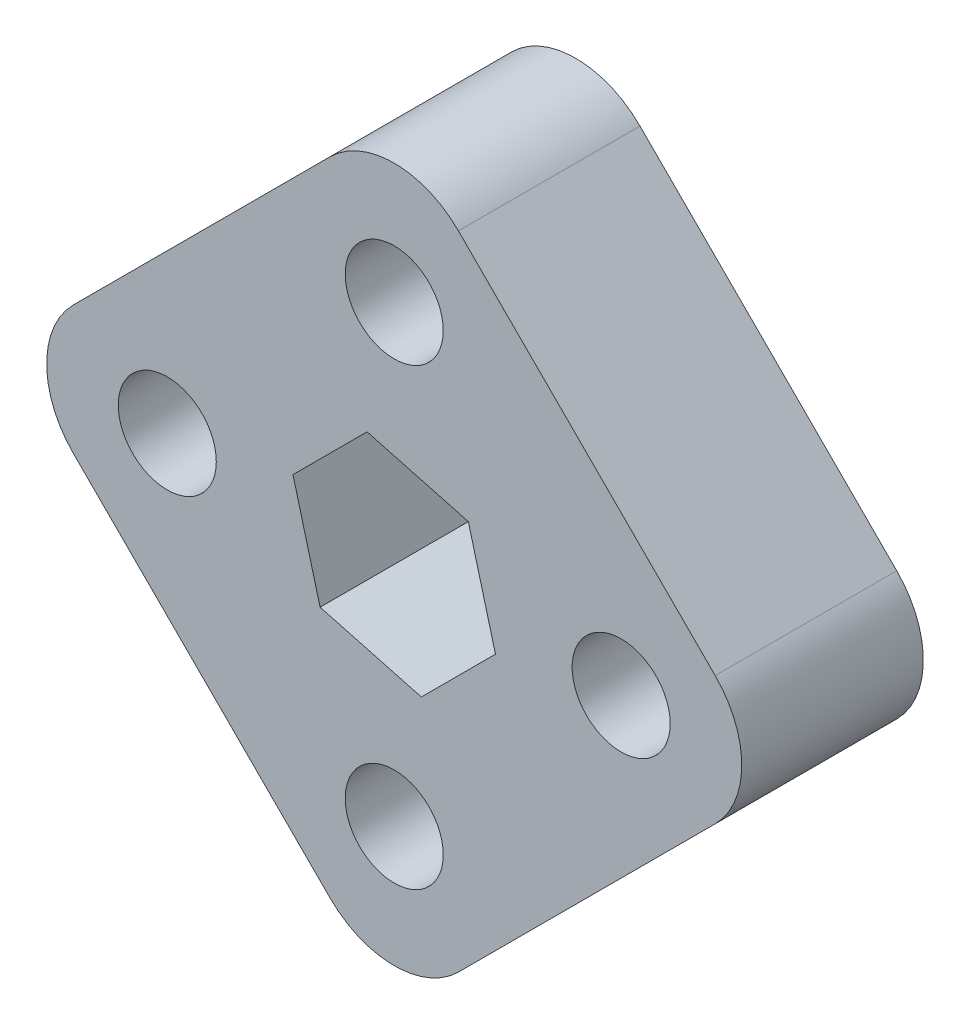
ISO-10303-21;
HEADER;
FILE_DESCRIPTION(('STEP AP214'),'2;1');
FILE_NAME('part.step','',(''),(''),'','','');
FILE_SCHEMA(('AUTOMOTIVE_DESIGN { 1 0 10303 214 1 1 1 1 }'));
ENDSEC;
DATA;
#1=APPLICATION_CONTEXT('core data for automotive mechanical design processes');
#2=APPLICATION_PROTOCOL_DEFINITION('international standard','automotive_design',2000,#1);
#3=PRODUCT_CONTEXT('',#1,'mechanical');
#4=PRODUCT('Part','Part','',(#3));
#5=PRODUCT_RELATED_PRODUCT_CATEGORY('part','',(#4));
#6=PRODUCT_DEFINITION_FORMATION('','',#4);
#7=PRODUCT_DEFINITION_CONTEXT('part definition',#1,'design');
#8=PRODUCT_DEFINITION('design','',#6,#7);
#9=PRODUCT_DEFINITION_SHAPE('','',#8);
#10=(LENGTH_UNIT() NAMED_UNIT(*) SI_UNIT(.MILLI.,.METRE.));
#11=(NAMED_UNIT(*) PLANE_ANGLE_UNIT() SI_UNIT($,.RADIAN.));
#12=(NAMED_UNIT(*) SI_UNIT($,.STERADIAN.) SOLID_ANGLE_UNIT());
#13=UNCERTAINTY_MEASURE_WITH_UNIT(LENGTH_MEASURE(1.E-05),#10,'distance_accuracy_value','');
#14=(GEOMETRIC_REPRESENTATION_CONTEXT(3) GLOBAL_UNCERTAINTY_ASSIGNED_CONTEXT((#13)) GLOBAL_UNIT_ASSIGNED_CONTEXT((#10,
#11,#12)) REPRESENTATION_CONTEXT('',''));
#15=CARTESIAN_POINT('',(0.,0.,0.));
#16=DIRECTION('',(0.,0.,1.));
#17=DIRECTION('',(1.,0.,0.));
#18=AXIS2_PLACEMENT_3D('',#15,#16,#17);
#19=CARTESIAN_POINT('',(-17.9605122421383,0.,12.7));
#20=DIRECTION('',(0.,0.,1.));
#21=DIRECTION('',(1.,0.,0.));
#22=AXIS2_PLACEMENT_3D('',#19,#20,#21);
#23=PLANE('',#22);
#24=CARTESIAN_POINT('',(0.,-15.875,12.7));
#25=DIRECTION('',(0.,0.,1.));
#26=DIRECTION('',(1.,0.,0.));
#27=AXIS2_PLACEMENT_3D('',#24,#25,#26);
#28=CIRCLE('',#27,3.42900000000011);
#29=CARTESIAN_POINT('',(3.42900000000011,-15.875,12.7));
#30=VERTEX_POINT('',#29);
#31=EDGE_CURVE('E410',#30,#30,#28,.T.);
#32=ORIENTED_EDGE('',*,*,#31,.F.);
#33=EDGE_LOOP('',(#32));
#34=FACE_BOUND('',#33,.T.);
#35=CARTESIAN_POINT('',(0.,15.875,12.7));
#36=DIRECTION('',(0.,0.,1.));
#37=DIRECTION('',(1.,0.,0.));
#38=AXIS2_PLACEMENT_3D('',#35,#36,#37);
#39=CIRCLE('',#38,3.429);
#40=CARTESIAN_POINT('',(3.429,15.875,12.7));
#41=VERTEX_POINT('',#40);
#42=EDGE_CURVE('E189',#41,#41,#39,.T.);
#43=ORIENTED_EDGE('',*,*,#42,.F.);
#44=EDGE_LOOP('',(#43));
#45=FACE_BOUND('',#44,.T.);
#46=CARTESIAN_POINT('',(-17.9605122421383,0.,12.7));
#47=DIRECTION('',(0.,0.,1.));
#48=DIRECTION('',(1.,0.,0.));
#49=AXIS2_PLACEMENT_3D('',#46,#47,#48);
#50=CIRCLE('',#49,6.35);
#51=CARTESIAN_POINT('',(-22.4506403026728,4.49012806053461,12.7));
#52=VERTEX_POINT('',#51);
#53=CARTESIAN_POINT('',(-22.4506403026728,-4.4901280605346,12.7));
#54=VERTEX_POINT('',#53);
#55=EDGE_CURVE('E219',#52,#54,#50,.T.);
#56=ORIENTED_EDGE('',*,*,#55,.T.);
#57=DIRECTION('',(0.707106781186547,-0.707106781186548,0.));
#58=VECTOR('',#57,1.);
#59=CARTESIAN_POINT('',(-22.4506403026728,-4.4901280605346,12.7));
#60=LINE('',#59,#58);
#61=CARTESIAN_POINT('',(-4.49012806053461,-22.4506403026729,12.7));
#62=VERTEX_POINT('',#61);
#63=EDGE_CURVE('E223',#54,#62,#60,.T.);
#64=ORIENTED_EDGE('',*,*,#63,.T.);
#65=CARTESIAN_POINT('',(0.,-17.9605122421383,12.7));
#66=DIRECTION('',(0.,0.,1.));
#67=DIRECTION('',(1.,0.,0.));
#68=AXIS2_PLACEMENT_3D('',#65,#66,#67);
#69=CIRCLE('',#68,6.35);
#70=CARTESIAN_POINT('',(4.49012806053461,-22.4506403026729,12.7));
#71=VERTEX_POINT('',#70);
#72=EDGE_CURVE('E227',#62,#71,#69,.T.);
#73=ORIENTED_EDGE('',*,*,#72,.T.);
#74=DIRECTION('',(0.707106781186547,0.707106781186547,0.));
#75=VECTOR('',#74,1.);
#76=CARTESIAN_POINT('',(4.49012806053461,-22.4506403026729,12.7));
#77=LINE('',#76,#75);
#78=CARTESIAN_POINT('',(22.4506403026729,-4.49012806053461,12.7));
#79=VERTEX_POINT('',#78);
#80=EDGE_CURVE('E230',#71,#79,#77,.T.);
#81=ORIENTED_EDGE('',*,*,#80,.T.);
#82=CARTESIAN_POINT('',(17.9605122421383,0.,12.7));
#83=DIRECTION('',(0.,0.,1.));
#84=DIRECTION('',(1.,0.,0.));
#85=AXIS2_PLACEMENT_3D('',#82,#83,#84);
#86=CIRCLE('',#85,6.35);
#87=CARTESIAN_POINT('',(22.4506403026729,4.49012806053461,12.7));
#88=VERTEX_POINT('',#87);
#89=EDGE_CURVE('E233',#79,#88,#86,.T.);
#90=ORIENTED_EDGE('',*,*,#89,.T.);
#91=DIRECTION('',(-0.707106781186548,0.707106781186548,0.));
#92=VECTOR('',#91,1.);
#93=CARTESIAN_POINT('',(22.4506403026729,4.49012806053461,12.7));
#94=LINE('',#93,#92);
#95=CARTESIAN_POINT('',(4.49012806053462,22.4506403026729,12.7));
#96=VERTEX_POINT('',#95);
#97=EDGE_CURVE('E236',#88,#96,#94,.T.);
#98=ORIENTED_EDGE('',*,*,#97,.T.);
#99=CARTESIAN_POINT('',(0.,17.9605122421383,12.7));
#100=DIRECTION('',(0.,0.,1.));
#101=DIRECTION('',(1.,0.,0.));
#102=AXIS2_PLACEMENT_3D('',#99,#100,#101);
#103=CIRCLE('',#102,6.35);
#104=CARTESIAN_POINT('',(-4.4901280605346,22.4506403026729,12.7));
#105=VERTEX_POINT('',#104);
#106=EDGE_CURVE('E239',#96,#105,#103,.T.);
#107=ORIENTED_EDGE('',*,*,#106,.T.);
#108=DIRECTION('',(-0.707106781186548,-0.707106781186547,0.));
#109=VECTOR('',#108,1.);
#110=CARTESIAN_POINT('',(-4.4901280605346,22.4506403026729,12.7));
#111=LINE('',#110,#109);
#112=EDGE_CURVE('E242',#105,#52,#111,.T.);
#113=ORIENTED_EDGE('',*,*,#112,.T.);
#114=EDGE_LOOP('',(#56,#64,#73,#81,#90,#98,#107,#113));
#115=FACE_BOUND('',#114,.T.);
#116=DIRECTION('',(-0.965925826289068,0.258819045102521,0.));
#117=VECTOR('',#116,1.);
#118=CARTESIAN_POINT('',(5.18475328889106,5.18475328889106,12.7));
#119=LINE('',#118,#117);
#120=CARTESIAN_POINT('',(5.18475328889106,5.18475328889106,12.7));
#121=VERTEX_POINT('',#120);
#122=CARTESIAN_POINT('',(-1.89775141608905,7.08250470498011,12.7));
#123=VERTEX_POINT('',#122);
#124=EDGE_CURVE('E156',#121,#123,#119,.T.);
#125=ORIENTED_EDGE('',*,*,#124,.F.);
#126=DIRECTION('',(-0.258819045102521,0.965925826289068,0.));
#127=VECTOR('',#126,1.);
#128=CARTESIAN_POINT('',(7.08250470498011,-1.89775141608905,12.7));
#129=LINE('',#128,#127);
#130=CARTESIAN_POINT('',(7.08250470498011,-1.89775141608905,12.7));
#131=VERTEX_POINT('',#130);
#132=EDGE_CURVE('E147',#131,#121,#129,.T.);
#133=ORIENTED_EDGE('',*,*,#132,.F.);
#134=DIRECTION('',(0.707106781186547,0.707106781186548,0.));
#135=VECTOR('',#134,1.);
#136=CARTESIAN_POINT('',(1.89775141608905,-7.08250470498011,12.7));
#137=LINE('',#136,#135);
#138=CARTESIAN_POINT('',(1.89775141608905,-7.08250470498011,12.7));
#139=VERTEX_POINT('',#138);
#140=EDGE_CURVE('E184',#139,#131,#137,.T.);
#141=ORIENTED_EDGE('',*,*,#140,.F.);
#142=DIRECTION('',(0.965925826289068,-0.258819045102521,0.));
#143=VECTOR('',#142,1.);
#144=CARTESIAN_POINT('',(-5.18475328889106,-5.18475328889106,12.7));
#145=LINE('',#144,#143);
#146=CARTESIAN_POINT('',(-5.18475328889106,-5.18475328889106,12.7));
#147=VERTEX_POINT('',#146);
#148=EDGE_CURVE('E181',#147,#139,#145,.T.);
#149=ORIENTED_EDGE('',*,*,#148,.F.);
#150=DIRECTION('',(0.258819045102521,-0.965925826289068,0.));
#151=VECTOR('',#150,1.);
#152=CARTESIAN_POINT('',(-7.08250470498011,1.89775141608905,12.7));
#153=LINE('',#152,#151);
#154=CARTESIAN_POINT('',(-7.08250470498011,1.89775141608905,12.7));
#155=VERTEX_POINT('',#154);
#156=EDGE_CURVE('E175',#155,#147,#153,.T.);
#157=ORIENTED_EDGE('',*,*,#156,.F.);
#158=DIRECTION('',(-0.707106781186547,-0.707106781186548,0.));
#159=VECTOR('',#158,1.);
#160=CARTESIAN_POINT('',(-1.89775141608905,7.08250470498011,12.7));
#161=LINE('',#160,#159);
#162=EDGE_CURVE('E171',#123,#155,#161,.T.);
#163=ORIENTED_EDGE('',*,*,#162,.F.);
#164=EDGE_LOOP('',(#125,#133,#141,#149,#157,#163));
#165=FACE_BOUND('',#164,.T.);
#166=CARTESIAN_POINT('',(15.875,0.,12.7));
#167=DIRECTION('',(0.,0.,1.));
#168=DIRECTION('',(1.,0.,0.));
#169=AXIS2_PLACEMENT_3D('',#166,#167,#168);
#170=CIRCLE('',#169,3.429);
#171=CARTESIAN_POINT('',(19.304,0.,12.7));
#172=VERTEX_POINT('',#171);
#173=EDGE_CURVE('E418',#172,#172,#170,.T.);
#174=ORIENTED_EDGE('',*,*,#173,.F.);
#175=EDGE_LOOP('',(#174));
#176=FACE_BOUND('',#175,.T.);
#177=CARTESIAN_POINT('',(-15.875,1.66281798762404E-13,12.7));
#178=DIRECTION('',(0.,0.,1.));
#179=DIRECTION('',(1.,0.,0.));
#180=AXIS2_PLACEMENT_3D('',#177,#178,#179);
#181=CIRCLE('',#180,3.429);
#182=CARTESIAN_POINT('',(-12.446,1.66281798762404E-13,12.7));
#183=VERTEX_POINT('',#182);
#184=EDGE_CURVE('E399',#183,#183,#181,.T.);
#185=ORIENTED_EDGE('',*,*,#184,.F.);
#186=EDGE_LOOP('',(#185));
#187=FACE_BOUND('',#186,.T.);
#188=ADVANCED_FACE('F45',(#34,#45,#115,#165,#176,#187),#23,.T.);
#189=CARTESIAN_POINT('',(-17.9605122421383,0.,0.));
#190=DIRECTION('',(0.,0.,1.));
#191=DIRECTION('',(1.,0.,0.));
#192=AXIS2_PLACEMENT_3D('',#189,#190,#191);
#193=PLANE('',#192);
#194=CARTESIAN_POINT('',(-17.9605122421383,0.,0.));
#195=DIRECTION('',(0.,0.,1.));
#196=DIRECTION('',(1.,0.,0.));
#197=AXIS2_PLACEMENT_3D('',#194,#195,#196);
#198=CIRCLE('',#197,6.35);
#199=CARTESIAN_POINT('',(-22.4506403026728,4.49012806053461,0.));
#200=VERTEX_POINT('',#199);
#201=CARTESIAN_POINT('',(-22.4506403026728,-4.4901280605346,0.));
#202=VERTEX_POINT('',#201);
#203=EDGE_CURVE('E165',#200,#202,#198,.T.);
#204=ORIENTED_EDGE('',*,*,#203,.F.);
#205=DIRECTION('',(-0.707106781186548,-0.707106781186547,0.));
#206=VECTOR('',#205,1.);
#207=CARTESIAN_POINT('',(-4.4901280605346,22.4506403026729,0.));
#208=LINE('',#207,#206);
#209=CARTESIAN_POINT('',(-4.4901280605346,22.4506403026729,0.));
#210=VERTEX_POINT('',#209);
#211=EDGE_CURVE('E224',#210,#200,#208,.T.);
#212=ORIENTED_EDGE('',*,*,#211,.F.);
#213=CARTESIAN_POINT('',(0.,17.9605122421383,0.));
#214=DIRECTION('',(0.,0.,1.));
#215=DIRECTION('',(1.,0.,0.));
#216=AXIS2_PLACEMENT_3D('',#213,#214,#215);
#217=CIRCLE('',#216,6.35);
#218=CARTESIAN_POINT('',(4.49012806053462,22.4506403026729,0.));
#219=VERTEX_POINT('',#218);
#220=EDGE_CURVE('E264',#219,#210,#217,.T.);
#221=ORIENTED_EDGE('',*,*,#220,.F.);
#222=DIRECTION('',(-0.707106781186548,0.707106781186548,0.));
#223=VECTOR('',#222,1.);
#224=CARTESIAN_POINT('',(22.4506403026729,4.49012806053461,0.));
#225=LINE('',#224,#223);
#226=CARTESIAN_POINT('',(22.4506403026729,4.49012806053461,0.));
#227=VERTEX_POINT('',#226);
#228=EDGE_CURVE('E261',#227,#219,#225,.T.);
#229=ORIENTED_EDGE('',*,*,#228,.F.);
#230=CARTESIAN_POINT('',(17.9605122421383,0.,0.));
#231=DIRECTION('',(0.,0.,1.));
#232=DIRECTION('',(1.,0.,0.));
#233=AXIS2_PLACEMENT_3D('',#230,#231,#232);
#234=CIRCLE('',#233,6.35);
#235=CARTESIAN_POINT('',(22.4506403026729,-4.49012806053461,0.));
#236=VERTEX_POINT('',#235);
#237=EDGE_CURVE('E258',#236,#227,#234,.T.);
#238=ORIENTED_EDGE('',*,*,#237,.F.);
#239=DIRECTION('',(0.707106781186547,0.707106781186547,0.));
#240=VECTOR('',#239,1.);
#241=CARTESIAN_POINT('',(4.49012806053461,-22.4506403026729,0.));
#242=LINE('',#241,#240);
#243=CARTESIAN_POINT('',(4.49012806053461,-22.4506403026729,0.));
#244=VERTEX_POINT('',#243);
#245=EDGE_CURVE('E255',#244,#236,#242,.T.);
#246=ORIENTED_EDGE('',*,*,#245,.F.);
#247=CARTESIAN_POINT('',(0.,-17.9605122421383,0.));
#248=DIRECTION('',(0.,0.,1.));
#249=DIRECTION('',(1.,0.,0.));
#250=AXIS2_PLACEMENT_3D('',#247,#248,#249);
#251=CIRCLE('',#250,6.35);
#252=CARTESIAN_POINT('',(-4.49012806053461,-22.4506403026729,0.));
#253=VERTEX_POINT('',#252);
#254=EDGE_CURVE('E252',#253,#244,#251,.T.);
#255=ORIENTED_EDGE('',*,*,#254,.F.);
#256=DIRECTION('',(0.707106781186547,-0.707106781186548,0.));
#257=VECTOR('',#256,1.);
#258=CARTESIAN_POINT('',(-22.4506403026728,-4.4901280605346,0.));
#259=LINE('',#258,#257);
#260=EDGE_CURVE('E249',#202,#253,#259,.T.);
#261=ORIENTED_EDGE('',*,*,#260,.F.);
#262=EDGE_LOOP('',(#204,#212,#221,#229,#238,#246,#255,#261));
#263=FACE_BOUND('',#262,.T.);
#264=DIRECTION('',(-0.258819045102521,0.965925826289068,0.));
#265=VECTOR('',#264,1.);
#266=CARTESIAN_POINT('',(7.08250470498011,-1.89775141608905,0.));
#267=LINE('',#266,#265);
#268=CARTESIAN_POINT('',(7.08250470498011,-1.89775141608905,0.));
#269=VERTEX_POINT('',#268);
#270=CARTESIAN_POINT('',(5.18475328889106,5.18475328889106,0.));
#271=VERTEX_POINT('',#270);
#272=EDGE_CURVE('E69',#269,#271,#267,.T.);
#273=ORIENTED_EDGE('',*,*,#272,.T.);
#274=DIRECTION('',(-0.965925826289068,0.258819045102521,0.));
#275=VECTOR('',#274,1.);
#276=CARTESIAN_POINT('',(5.18475328889106,5.18475328889106,0.));
#277=LINE('',#276,#275);
#278=CARTESIAN_POINT('',(-1.89775141608905,7.08250470498011,0.));
#279=VERTEX_POINT('',#278);
#280=EDGE_CURVE('E163',#271,#279,#277,.T.);
#281=ORIENTED_EDGE('',*,*,#280,.T.);
#282=DIRECTION('',(-0.707106781186547,-0.707106781186548,0.));
#283=VECTOR('',#282,1.);
#284=CARTESIAN_POINT('',(-1.89775141608905,7.08250470498011,0.));
#285=LINE('',#284,#283);
#286=CARTESIAN_POINT('',(-7.08250470498011,1.89775141608905,0.));
#287=VERTEX_POINT('',#286);
#288=EDGE_CURVE('E192',#279,#287,#285,.T.);
#289=ORIENTED_EDGE('',*,*,#288,.T.);
#290=DIRECTION('',(0.258819045102521,-0.965925826289068,0.));
#291=VECTOR('',#290,1.);
#292=CARTESIAN_POINT('',(-7.08250470498011,1.89775141608905,0.));
#293=LINE('',#292,#291);
#294=CARTESIAN_POINT('',(-5.18475328889106,-5.18475328889106,0.));
#295=VERTEX_POINT('',#294);
#296=EDGE_CURVE('E196',#287,#295,#293,.T.);
#297=ORIENTED_EDGE('',*,*,#296,.T.);
#298=DIRECTION('',(0.965925826289068,-0.258819045102521,0.));
#299=VECTOR('',#298,1.);
#300=CARTESIAN_POINT('',(-5.18475328889106,-5.18475328889106,0.));
#301=LINE('',#300,#299);
#302=CARTESIAN_POINT('',(1.89775141608905,-7.08250470498011,0.));
#303=VERTEX_POINT('',#302);
#304=EDGE_CURVE('E200',#295,#303,#301,.T.);
#305=ORIENTED_EDGE('',*,*,#304,.T.);
#306=DIRECTION('',(0.707106781186547,0.707106781186548,0.));
#307=VECTOR('',#306,1.);
#308=CARTESIAN_POINT('',(1.89775141608905,-7.08250470498011,0.));
#309=LINE('',#308,#307);
#310=EDGE_CURVE('E157',#303,#269,#309,.T.);
#311=ORIENTED_EDGE('',*,*,#310,.T.);
#312=EDGE_LOOP('',(#273,#281,#289,#297,#305,#311));
#313=FACE_BOUND('',#312,.T.);
#314=CARTESIAN_POINT('',(0.,15.875,0.));
#315=DIRECTION('',(0.,0.,1.));
#316=DIRECTION('',(1.,0.,0.));
#317=AXIS2_PLACEMENT_3D('',#314,#315,#316);
#318=CIRCLE('',#317,3.429);
#319=CARTESIAN_POINT('',(3.429,15.875,0.));
#320=VERTEX_POINT('',#319);
#321=EDGE_CURVE('E422',#320,#320,#318,.T.);
#322=ORIENTED_EDGE('',*,*,#321,.T.);
#323=EDGE_LOOP('',(#322));
#324=FACE_BOUND('',#323,.T.);
#325=CARTESIAN_POINT('',(15.875,0.,0.));
#326=DIRECTION('',(0.,0.,1.));
#327=DIRECTION('',(1.,0.,0.));
#328=AXIS2_PLACEMENT_3D('',#325,#326,#327);
#329=CIRCLE('',#328,3.429);
#330=CARTESIAN_POINT('',(19.304,0.,0.));
#331=VERTEX_POINT('',#330);
#332=EDGE_CURVE('E414',#331,#331,#329,.T.);
#333=ORIENTED_EDGE('',*,*,#332,.T.);
#334=EDGE_LOOP('',(#333));
#335=FACE_BOUND('',#334,.T.);
#336=CARTESIAN_POINT('',(0.,-15.875,0.));
#337=DIRECTION('',(0.,0.,1.));
#338=DIRECTION('',(1.,0.,0.));
#339=AXIS2_PLACEMENT_3D('',#336,#337,#338);
#340=CIRCLE('',#339,3.42900000000011);
#341=CARTESIAN_POINT('',(3.42900000000011,-15.875,0.));
#342=VERTEX_POINT('',#341);
#343=EDGE_CURVE('E407',#342,#342,#340,.T.);
#344=ORIENTED_EDGE('',*,*,#343,.T.);
#345=EDGE_LOOP('',(#344));
#346=FACE_BOUND('',#345,.T.);
#347=CARTESIAN_POINT('',(-15.875,1.66281798762404E-13,0.));
#348=DIRECTION('',(0.,0.,1.));
#349=DIRECTION('',(1.,0.,0.));
#350=AXIS2_PLACEMENT_3D('',#347,#348,#349);
#351=CIRCLE('',#350,3.429);
#352=CARTESIAN_POINT('',(-12.446,1.66281798762404E-13,0.));
#353=VERTEX_POINT('',#352);
#354=EDGE_CURVE('E402',#353,#353,#351,.T.);
#355=ORIENTED_EDGE('',*,*,#354,.T.);
#356=EDGE_LOOP('',(#355));
#357=FACE_BOUND('',#356,.T.);
#358=ADVANCED_FACE('F303',(#263,#313,#324,#335,#346,#357),#193,.F.);
#359=CARTESIAN_POINT('',(-17.9605122421383,0.,12.7));
#360=DIRECTION('',(0.,0.,-1.));
#361=DIRECTION('',(-1.,0.,0.));
#362=AXIS2_PLACEMENT_3D('',#359,#360,#361);
#363=CYLINDRICAL_SURFACE('',#362,6.35);
#364=ORIENTED_EDGE('',*,*,#203,.T.);
#365=DIRECTION('',(0.,0.,-1.));
#366=VECTOR('',#365,1.);
#367=CARTESIAN_POINT('',(-22.4506403026728,-4.4901280605346,12.7));
#368=LINE('',#367,#366);
#369=EDGE_CURVE('E11',#54,#202,#368,.T.);
#370=ORIENTED_EDGE('',*,*,#369,.F.);
#371=ORIENTED_EDGE('',*,*,#55,.F.);
#372=DIRECTION('',(0.,0.,-1.));
#373=VECTOR('',#372,1.);
#374=CARTESIAN_POINT('',(-22.4506403026728,4.49012806053461,12.7));
#375=LINE('',#374,#373);
#376=EDGE_CURVE('E245',#52,#200,#375,.T.);
#377=ORIENTED_EDGE('',*,*,#376,.T.);
#378=EDGE_LOOP('',(#364,#370,#371,#377));
#379=FACE_BOUND('',#378,.T.);
#380=ADVANCED_FACE('F47',(#379),#363,.T.);
#381=CARTESIAN_POINT('',(-22.4506403026728,-4.4901280605346,12.7));
#382=DIRECTION('',(0.707106781186548,0.707106781186547,0.));
#383=DIRECTION('',(-0.707106781186547,0.707106781186548,0.));
#384=AXIS2_PLACEMENT_3D('',#381,#382,#383);
#385=PLANE('',#384);
#386=ORIENTED_EDGE('',*,*,#260,.T.);
#387=DIRECTION('',(0.,0.,-1.));
#388=VECTOR('',#387,1.);
#389=CARTESIAN_POINT('',(-4.49012806053461,-22.4506403026729,12.7));
#390=LINE('',#389,#388);
#391=EDGE_CURVE('E54',#62,#253,#390,.T.);
#392=ORIENTED_EDGE('',*,*,#391,.F.);
#393=ORIENTED_EDGE('',*,*,#63,.F.);
#394=ORIENTED_EDGE('',*,*,#369,.T.);
#395=EDGE_LOOP('',(#386,#392,#393,#394));
#396=FACE_BOUND('',#395,.T.);
#397=ADVANCED_FACE('F320',(#396),#385,.F.);
#398=CARTESIAN_POINT('',(0.,-17.9605122421383,12.7));
#399=DIRECTION('',(0.,0.,-1.));
#400=DIRECTION('',(-1.,0.,0.));
#401=AXIS2_PLACEMENT_3D('',#398,#399,#400);
#402=CYLINDRICAL_SURFACE('',#401,6.35);
#403=ORIENTED_EDGE('',*,*,#254,.T.);
#404=DIRECTION('',(0.,0.,-1.));
#405=VECTOR('',#404,1.);
#406=CARTESIAN_POINT('',(4.49012806053461,-22.4506403026729,12.7));
#407=LINE('',#406,#405);
#408=EDGE_CURVE('E288',#71,#244,#407,.T.);
#409=ORIENTED_EDGE('',*,*,#408,.F.);
#410=ORIENTED_EDGE('',*,*,#72,.F.);
#411=ORIENTED_EDGE('',*,*,#391,.T.);
#412=EDGE_LOOP('',(#403,#409,#410,#411));
#413=FACE_BOUND('',#412,.T.);
#414=ADVANCED_FACE('F297',(#413),#402,.T.);
#415=CARTESIAN_POINT('',(4.49012806053461,-22.4506403026729,12.7));
#416=DIRECTION('',(-0.707106781186548,0.707106781186548,0.));
#417=DIRECTION('',(-0.707106781186548,-0.707106781186548,0.));
#418=AXIS2_PLACEMENT_3D('',#415,#416,#417);
#419=PLANE('',#418);
#420=ORIENTED_EDGE('',*,*,#245,.T.);
#421=DIRECTION('',(0.,0.,-1.));
#422=VECTOR('',#421,1.);
#423=CARTESIAN_POINT('',(22.4506403026729,-4.49012806053461,12.7));
#424=LINE('',#423,#422);
#425=EDGE_CURVE('E284',#79,#236,#424,.T.);
#426=ORIENTED_EDGE('',*,*,#425,.F.);
#427=ORIENTED_EDGE('',*,*,#80,.F.);
#428=ORIENTED_EDGE('',*,*,#408,.T.);
#429=EDGE_LOOP('',(#420,#426,#427,#428));
#430=FACE_BOUND('',#429,.T.);
#431=ADVANCED_FACE('F309',(#430),#419,.F.);
#432=CARTESIAN_POINT('',(17.9605122421383,0.,12.7));
#433=DIRECTION('',(0.,0.,-1.));
#434=DIRECTION('',(-1.,0.,0.));
#435=AXIS2_PLACEMENT_3D('',#432,#433,#434);
#436=CYLINDRICAL_SURFACE('',#435,6.35);
#437=ORIENTED_EDGE('',*,*,#237,.T.);
#438=DIRECTION('',(0.,0.,-1.));
#439=VECTOR('',#438,1.);
#440=CARTESIAN_POINT('',(22.4506403026729,4.49012806053461,12.7));
#441=LINE('',#440,#439);
#442=EDGE_CURVE('E280',#88,#227,#441,.T.);
#443=ORIENTED_EDGE('',*,*,#442,.F.);
#444=ORIENTED_EDGE('',*,*,#89,.F.);
#445=ORIENTED_EDGE('',*,*,#425,.T.);
#446=EDGE_LOOP('',(#437,#443,#444,#445));
#447=FACE_BOUND('',#446,.T.);
#448=ADVANCED_FACE('F313',(#447),#436,.T.);
#449=CARTESIAN_POINT('',(22.4506403026729,4.49012806053461,12.7));
#450=DIRECTION('',(-0.707106781186548,-0.707106781186548,0.));
#451=DIRECTION('',(0.707106781186548,-0.707106781186548,0.));
#452=AXIS2_PLACEMENT_3D('',#449,#450,#451);
#453=PLANE('',#452);
#454=ORIENTED_EDGE('',*,*,#228,.T.);
#455=DIRECTION('',(0.,0.,-1.));
#456=VECTOR('',#455,1.);
#457=CARTESIAN_POINT('',(4.49012806053462,22.4506403026729,12.7));
#458=LINE('',#457,#456);
#459=EDGE_CURVE('E276',#96,#219,#458,.T.);
#460=ORIENTED_EDGE('',*,*,#459,.F.);
#461=ORIENTED_EDGE('',*,*,#97,.F.);
#462=ORIENTED_EDGE('',*,*,#442,.T.);
#463=EDGE_LOOP('',(#454,#460,#461,#462));
#464=FACE_BOUND('',#463,.T.);
#465=ADVANCED_FACE('F333',(#464),#453,.F.);
#466=CARTESIAN_POINT('',(0.,17.9605122421383,12.7));
#467=DIRECTION('',(0.,0.,-1.));
#468=DIRECTION('',(-1.,0.,0.));
#469=AXIS2_PLACEMENT_3D('',#466,#467,#468);
#470=CYLINDRICAL_SURFACE('',#469,6.35);
#471=ORIENTED_EDGE('',*,*,#220,.T.);
#472=DIRECTION('',(0.,0.,-1.));
#473=VECTOR('',#472,1.);
#474=CARTESIAN_POINT('',(-4.4901280605346,22.4506403026729,12.7));
#475=LINE('',#474,#473);
#476=EDGE_CURVE('E272',#105,#210,#475,.T.);
#477=ORIENTED_EDGE('',*,*,#476,.F.);
#478=ORIENTED_EDGE('',*,*,#106,.F.);
#479=ORIENTED_EDGE('',*,*,#459,.T.);
#480=EDGE_LOOP('',(#471,#477,#478,#479));
#481=FACE_BOUND('',#480,.T.);
#482=ADVANCED_FACE('F331',(#481),#470,.T.);
#483=CARTESIAN_POINT('',(-4.4901280605346,22.4506403026729,12.7));
#484=DIRECTION('',(0.707106781186547,-0.707106781186548,0.));
#485=DIRECTION('',(0.707106781186548,0.707106781186547,0.));
#486=AXIS2_PLACEMENT_3D('',#483,#484,#485);
#487=PLANE('',#486);
#488=ORIENTED_EDGE('',*,*,#211,.T.);
#489=ORIENTED_EDGE('',*,*,#376,.F.);
#490=ORIENTED_EDGE('',*,*,#112,.F.);
#491=ORIENTED_EDGE('',*,*,#476,.T.);
#492=EDGE_LOOP('',(#488,#489,#490,#491));
#493=FACE_BOUND('',#492,.T.);
#494=ADVANCED_FACE('F326',(#493),#487,.F.);
#495=CARTESIAN_POINT('',(7.08250470498011,-1.89775141608905,12.7));
#496=DIRECTION('',(-0.965925826289068,-0.258819045102521,0.));
#497=DIRECTION('',(0.258819045102521,-0.965925826289068,0.));
#498=AXIS2_PLACEMENT_3D('',#495,#496,#497);
#499=PLANE('',#498);
#500=ORIENTED_EDGE('',*,*,#272,.F.);
#501=DIRECTION('',(0.,0.,-1.));
#502=VECTOR('',#501,1.);
#503=CARTESIAN_POINT('',(7.08250470498011,-1.89775141608905,12.7));
#504=LINE('',#503,#502);
#505=EDGE_CURVE('E151',#131,#269,#504,.T.);
#506=ORIENTED_EDGE('',*,*,#505,.F.);
#507=ORIENTED_EDGE('',*,*,#132,.T.);
#508=DIRECTION('',(0.,0.,-1.));
#509=VECTOR('',#508,1.);
#510=CARTESIAN_POINT('',(5.18475328889106,5.18475328889106,12.7));
#511=LINE('',#510,#509);
#512=EDGE_CURVE('E150',#121,#271,#511,.T.);
#513=ORIENTED_EDGE('',*,*,#512,.T.);
#514=EDGE_LOOP('',(#500,#506,#507,#513));
#515=FACE_BOUND('',#514,.T.);
#516=ADVANCED_FACE('F149',(#515),#499,.T.);
#517=CARTESIAN_POINT('',(5.18475328889106,5.18475328889106,12.7));
#518=DIRECTION('',(-0.258819045102521,-0.965925826289068,0.));
#519=DIRECTION('',(0.965925826289068,-0.258819045102521,0.));
#520=AXIS2_PLACEMENT_3D('',#517,#518,#519);
#521=PLANE('',#520);
#522=ORIENTED_EDGE('',*,*,#280,.F.);
#523=ORIENTED_EDGE('',*,*,#512,.F.);
#524=ORIENTED_EDGE('',*,*,#124,.T.);
#525=DIRECTION('',(0.,0.,-1.));
#526=VECTOR('',#525,1.);
#527=CARTESIAN_POINT('',(-1.89775141608905,7.08250470498011,12.7));
#528=LINE('',#527,#526);
#529=EDGE_CURVE('E166',#123,#279,#528,.T.);
#530=ORIENTED_EDGE('',*,*,#529,.T.);
#531=EDGE_LOOP('',(#522,#523,#524,#530));
#532=FACE_BOUND('',#531,.T.);
#533=ADVANCED_FACE('F160',(#532),#521,.T.);
#534=CARTESIAN_POINT('',(-1.89775141608905,7.08250470498011,12.7));
#535=DIRECTION('',(0.707106781186548,-0.707106781186547,0.));
#536=DIRECTION('',(0.707106781186547,0.707106781186548,0.));
#537=AXIS2_PLACEMENT_3D('',#534,#535,#536);
#538=PLANE('',#537);
#539=ORIENTED_EDGE('',*,*,#288,.F.);
#540=ORIENTED_EDGE('',*,*,#529,.F.);
#541=ORIENTED_EDGE('',*,*,#162,.T.);
#542=DIRECTION('',(0.,0.,-1.));
#543=VECTOR('',#542,1.);
#544=CARTESIAN_POINT('',(-7.08250470498011,1.89775141608905,12.7));
#545=LINE('',#544,#543);
#546=EDGE_CURVE('E214',#155,#287,#545,.T.);
#547=ORIENTED_EDGE('',*,*,#546,.T.);
#548=EDGE_LOOP('',(#539,#540,#541,#547));
#549=FACE_BOUND('',#548,.T.);
#550=ADVANCED_FACE('F361',(#549),#538,.T.);
#551=CARTESIAN_POINT('',(-7.08250470498011,1.89775141608905,12.7));
#552=DIRECTION('',(0.965925826289068,0.258819045102521,0.));
#553=DIRECTION('',(-0.258819045102521,0.965925826289068,0.));
#554=AXIS2_PLACEMENT_3D('',#551,#552,#553);
#555=PLANE('',#554);
#556=ORIENTED_EDGE('',*,*,#296,.F.);
#557=ORIENTED_EDGE('',*,*,#546,.F.);
#558=ORIENTED_EDGE('',*,*,#156,.T.);
#559=DIRECTION('',(0.,0.,-1.));
#560=VECTOR('',#559,1.);
#561=CARTESIAN_POINT('',(-5.18475328889106,-5.18475328889106,12.7));
#562=LINE('',#561,#560);
#563=EDGE_CURVE('E211',#147,#295,#562,.T.);
#564=ORIENTED_EDGE('',*,*,#563,.T.);
#565=EDGE_LOOP('',(#556,#557,#558,#564));
#566=FACE_BOUND('',#565,.T.);
#567=ADVANCED_FACE('F365',(#566),#555,.T.);
#568=CARTESIAN_POINT('',(-5.18475328889106,-5.18475328889106,12.7));
#569=DIRECTION('',(0.258819045102521,0.965925826289068,0.));
#570=DIRECTION('',(-0.965925826289068,0.258819045102521,0.));
#571=AXIS2_PLACEMENT_3D('',#568,#569,#570);
#572=PLANE('',#571);
#573=ORIENTED_EDGE('',*,*,#304,.F.);
#574=ORIENTED_EDGE('',*,*,#563,.F.);
#575=ORIENTED_EDGE('',*,*,#148,.T.);
#576=DIRECTION('',(0.,0.,-1.));
#577=VECTOR('',#576,1.);
#578=CARTESIAN_POINT('',(1.89775141608905,-7.08250470498011,12.7));
#579=LINE('',#578,#577);
#580=EDGE_CURVE('E61',#139,#303,#579,.T.);
#581=ORIENTED_EDGE('',*,*,#580,.T.);
#582=EDGE_LOOP('',(#573,#574,#575,#581));
#583=FACE_BOUND('',#582,.T.);
#584=ADVANCED_FACE('F371',(#583),#572,.T.);
#585=CARTESIAN_POINT('',(1.89775141608905,-7.08250470498011,12.7));
#586=DIRECTION('',(-0.707106781186548,0.707106781186547,0.));
#587=DIRECTION('',(-0.707106781186547,-0.707106781186548,0.));
#588=AXIS2_PLACEMENT_3D('',#585,#586,#587);
#589=PLANE('',#588);
#590=ORIENTED_EDGE('',*,*,#310,.F.);
#591=ORIENTED_EDGE('',*,*,#580,.F.);
#592=ORIENTED_EDGE('',*,*,#140,.T.);
#593=ORIENTED_EDGE('',*,*,#505,.T.);
#594=EDGE_LOOP('',(#590,#591,#592,#593));
#595=FACE_BOUND('',#594,.T.);
#596=ADVANCED_FACE('F375',(#595),#589,.T.);
#597=CARTESIAN_POINT('',(0.,15.875,12.7));
#598=DIRECTION('',(0.,0.,-1.));
#599=DIRECTION('',(-1.,0.,0.));
#600=AXIS2_PLACEMENT_3D('',#597,#598,#599);
#601=CYLINDRICAL_SURFACE('',#600,3.429);
#602=ORIENTED_EDGE('',*,*,#42,.T.);
#603=EDGE_LOOP('',(#602));
#604=FACE_BOUND('',#603,.T.);
#605=ORIENTED_EDGE('',*,*,#321,.F.);
#606=EDGE_LOOP('',(#605));
#607=FACE_BOUND('',#606,.T.);
#608=ADVANCED_FACE('F379',(#604,#607),#601,.F.);
#609=CARTESIAN_POINT('',(15.875,0.,12.7));
#610=DIRECTION('',(0.,0.,-1.));
#611=DIRECTION('',(-1.,0.,0.));
#612=AXIS2_PLACEMENT_3D('',#609,#610,#611);
#613=CYLINDRICAL_SURFACE('',#612,3.429);
#614=ORIENTED_EDGE('',*,*,#173,.T.);
#615=EDGE_LOOP('',(#614));
#616=FACE_BOUND('',#615,.T.);
#617=ORIENTED_EDGE('',*,*,#332,.F.);
#618=EDGE_LOOP('',(#617));
#619=FACE_BOUND('',#618,.T.);
#620=ADVANCED_FACE('F382',(#616,#619),#613,.F.);
#621=CARTESIAN_POINT('',(0.,-15.875,12.7));
#622=DIRECTION('',(0.,0.,-1.));
#623=DIRECTION('',(-1.,0.,0.));
#624=AXIS2_PLACEMENT_3D('',#621,#622,#623);
#625=CYLINDRICAL_SURFACE('',#624,3.42900000000011);
#626=ORIENTED_EDGE('',*,*,#31,.T.);
#627=EDGE_LOOP('',(#626));
#628=FACE_BOUND('',#627,.T.);
#629=ORIENTED_EDGE('',*,*,#343,.F.);
#630=EDGE_LOOP('',(#629));
#631=FACE_BOUND('',#630,.T.);
#632=ADVANCED_FACE('F386',(#628,#631),#625,.F.);
#633=CARTESIAN_POINT('',(-15.875,1.66281798762404E-13,12.7));
#634=DIRECTION('',(0.,0.,-1.));
#635=DIRECTION('',(-1.,0.,0.));
#636=AXIS2_PLACEMENT_3D('',#633,#634,#635);
#637=CYLINDRICAL_SURFACE('',#636,3.429);
#638=ORIENTED_EDGE('',*,*,#184,.T.);
#639=EDGE_LOOP('',(#638));
#640=FACE_BOUND('',#639,.T.);
#641=ORIENTED_EDGE('',*,*,#354,.F.);
#642=EDGE_LOOP('',(#641));
#643=FACE_BOUND('',#642,.T.);
#644=ADVANCED_FACE('F390',(#640,#643),#637,.F.);
#645=CLOSED_SHELL('',(#188,#358,#380,#397,#414,#431,#448,#465,#482,#494,#516,#533,#550,#567,
#584,#596,#608,#620,#632,#644));
#646=MANIFOLD_SOLID_BREP('B2',#645);
#647=ADVANCED_BREP_SHAPE_REPRESENTATION('',(#18,#646),#14);
#648=SHAPE_DEFINITION_REPRESENTATION(#9,#647);
ENDSEC;
END-ISO-10303-21;
